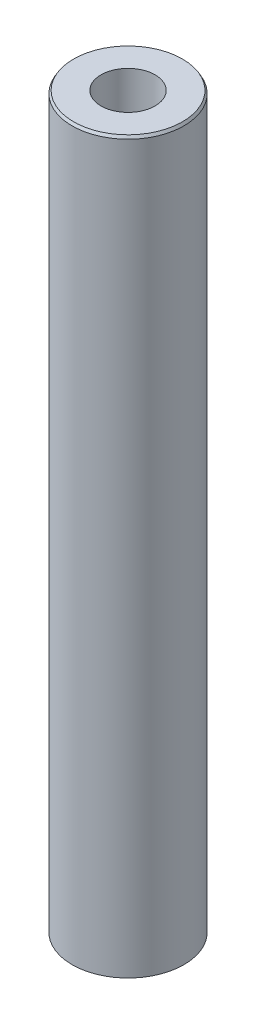
ISO-10303-21;
HEADER;
FILE_DESCRIPTION(('STEP AP214'),'2;1');
FILE_NAME('part.step','',(''),(''),'','','');
FILE_SCHEMA(('AUTOMOTIVE_DESIGN { 1 0 10303 214 1 1 1 1 }'));
ENDSEC;
DATA;
#1=APPLICATION_CONTEXT('core data for automotive mechanical design processes');
#2=APPLICATION_PROTOCOL_DEFINITION('international standard','automotive_design',2000,#1);
#3=PRODUCT_CONTEXT('',#1,'mechanical');
#4=PRODUCT('Part','Part','',(#3));
#5=PRODUCT_RELATED_PRODUCT_CATEGORY('part','',(#4));
#6=PRODUCT_DEFINITION_FORMATION('','',#4);
#7=PRODUCT_DEFINITION_CONTEXT('part definition',#1,'design');
#8=PRODUCT_DEFINITION('design','',#6,#7);
#9=PRODUCT_DEFINITION_SHAPE('','',#8);
#10=(LENGTH_UNIT() NAMED_UNIT(*) SI_UNIT(.MILLI.,.METRE.));
#11=(NAMED_UNIT(*) PLANE_ANGLE_UNIT() SI_UNIT($,.RADIAN.));
#12=(NAMED_UNIT(*) SI_UNIT($,.STERADIAN.) SOLID_ANGLE_UNIT());
#13=UNCERTAINTY_MEASURE_WITH_UNIT(LENGTH_MEASURE(1.E-05),#10,'distance_accuracy_value','');
#14=(GEOMETRIC_REPRESENTATION_CONTEXT(3) GLOBAL_UNCERTAINTY_ASSIGNED_CONTEXT((#13)) GLOBAL_UNIT_ASSIGNED_CONTEXT((#10,
#11,#12)) REPRESENTATION_CONTEXT('',''));
#15=CARTESIAN_POINT('',(0.,0.,0.));
#16=DIRECTION('',(0.,0.,1.));
#17=DIRECTION('',(1.,0.,0.));
#18=AXIS2_PLACEMENT_3D('',#15,#16,#17);
#19=CARTESIAN_POINT('',(0.,554.642758232559,0.));
#20=DIRECTION('',(0.,-1.,0.));
#21=DIRECTION('',(0.,0.,-1.));
#22=AXIS2_PLACEMENT_3D('',#19,#20,#21);
#23=CYLINDRICAL_SURFACE('',#22,42.5);
#24=CARTESIAN_POINT('',(0.,552.577452604285,0.));
#25=DIRECTION('',(0.,1.,0.));
#26=DIRECTION('',(0.,0.,1.));
#27=AXIS2_PLACEMENT_3D('',#24,#25,#26);
#28=CIRCLE('',#27,42.5);
#29=CARTESIAN_POINT('',(0.,552.577452604285,-42.5));
#30=VERTEX_POINT('',#29);
#31=EDGE_CURVE('E50',#30,#30,#28,.F.);
#32=ORIENTED_EDGE('',*,*,#31,.T.);
#33=EDGE_LOOP('',(#32));
#34=FACE_BOUND('',#33,.T.);
#35=CARTESIAN_POINT('',(0.,1.19240476044313,0.));
#36=DIRECTION('',(0.,1.,0.));
#37=DIRECTION('',(0.,0.,1.));
#38=AXIS2_PLACEMENT_3D('',#35,#36,#37);
#39=CIRCLE('',#38,42.5);
#40=CARTESIAN_POINT('',(0.,1.19240476044313,42.5));
#41=VERTEX_POINT('',#40);
#42=EDGE_CURVE('E51',#41,#41,#39,.T.);
#43=ORIENTED_EDGE('',*,*,#42,.T.);
#44=EDGE_LOOP('',(#43));
#45=FACE_BOUND('',#44,.T.);
#46=ADVANCED_FACE('F39',(#34,#45),#23,.T.);
#47=CARTESIAN_POINT('',(0.,554.642758232559,0.));
#48=DIRECTION('',(0.,1.,0.));
#49=DIRECTION('',(0.,0.,1.));
#50=AXIS2_PLACEMENT_3D('',#47,#48,#49);
#51=PLANE('',#50);
#52=CARTESIAN_POINT('',(0.,554.642758232559,0.));
#53=DIRECTION('',(0.,1.,0.));
#54=DIRECTION('',(0.,0.,1.));
#55=AXIS2_PLACEMENT_3D('',#52,#53,#54);
#56=CIRCLE('',#55,41.307595239557);
#57=CARTESIAN_POINT('',(0.,554.642758232559,-41.307595239557));
#58=VERTEX_POINT('',#57);
#59=EDGE_CURVE('E54',#58,#58,#56,.T.);
#60=ORIENTED_EDGE('',*,*,#59,.T.);
#61=EDGE_LOOP('',(#60));
#62=FACE_BOUND('',#61,.T.);
#63=CARTESIAN_POINT('',(0.,554.642758232559,0.));
#64=DIRECTION('',(0.,1.,0.));
#65=DIRECTION('',(0.,0.,1.));
#66=AXIS2_PLACEMENT_3D('',#63,#64,#65);
#67=CIRCLE('',#66,20.510029110894);
#68=CARTESIAN_POINT('',(0.,554.642758232559,20.510029110894));
#69=VERTEX_POINT('',#68);
#70=EDGE_CURVE('E58',#69,#69,#67,.T.);
#71=ORIENTED_EDGE('',*,*,#70,.F.);
#72=EDGE_LOOP('',(#71));
#73=FACE_BOUND('',#72,.T.);
#74=ADVANCED_FACE('F69',(#62,#73),#51,.T.);
#75=CARTESIAN_POINT('',(0.,0.,0.));
#76=DIRECTION('',(0.,1.,0.));
#77=DIRECTION('',(0.,0.,1.));
#78=AXIS2_PLACEMENT_3D('',#75,#76,#77);
#79=PLANE('',#78);
#80=CARTESIAN_POINT('',(0.,0.,0.));
#81=DIRECTION('',(0.,1.,0.));
#82=DIRECTION('',(0.,0.,1.));
#83=AXIS2_PLACEMENT_3D('',#80,#81,#82);
#84=CIRCLE('',#83,40.4346943717255);
#85=CARTESIAN_POINT('',(0.,0.,40.4346943717255));
#86=VERTEX_POINT('',#85);
#87=EDGE_CURVE('E10',#86,#86,#84,.F.);
#88=ORIENTED_EDGE('',*,*,#87,.T.);
#89=EDGE_LOOP('',(#88));
#90=FACE_BOUND('',#89,.T.);
#91=CARTESIAN_POINT('',(0.,0.,0.));
#92=DIRECTION('',(0.,1.,0.));
#93=DIRECTION('',(0.,0.,1.));
#94=AXIS2_PLACEMENT_3D('',#91,#92,#93);
#95=CIRCLE('',#94,20.510029110894);
#96=CARTESIAN_POINT('',(0.,0.,20.510029110894));
#97=VERTEX_POINT('',#96);
#98=EDGE_CURVE('E63',#97,#97,#95,.T.);
#99=ORIENTED_EDGE('',*,*,#98,.T.);
#100=EDGE_LOOP('',(#99));
#101=FACE_BOUND('',#100,.T.);
#102=ADVANCED_FACE('F75',(#90,#101),#79,.F.);
#103=CARTESIAN_POINT('',(0.,554.642758232559,0.));
#104=DIRECTION('',(0.,-1.,0.));
#105=DIRECTION('',(0.,0.,-1.));
#106=AXIS2_PLACEMENT_3D('',#103,#104,#105);
#107=CYLINDRICAL_SURFACE('',#106,20.510029110894);
#108=ORIENTED_EDGE('',*,*,#70,.T.);
#109=EDGE_LOOP('',(#108));
#110=FACE_BOUND('',#109,.T.);
#111=ORIENTED_EDGE('',*,*,#98,.F.);
#112=EDGE_LOOP('',(#111));
#113=FACE_BOUND('',#112,.T.);
#114=ADVANCED_FACE('F70',(#110,#113),#107,.F.);
#115=CARTESIAN_POINT('',(0.,554.642758232559,0.));
#116=DIRECTION('',(0.,-1.,0.));
#117=DIRECTION('',(0.,0.,-1.));
#118=AXIS2_PLACEMENT_3D('',#115,#116,#117);
#119=CONICAL_SURFACE('',#118,41.307595239557,0.52359877559828);
#120=CARTESIAN_POINT('',(0.,552.577452604285,-42.5));
#121=CARTESIAN_POINT('',(0.,552.598966204579,-42.4875791170787));
#122=CARTESIAN_POINT('',(0.,552.620479804874,-42.4751582341575));
#123=CARTESIAN_POINT('',(0.,552.663507005463,-42.4503164683149));
#124=CARTESIAN_POINT('',(0.,552.685020605757,-42.4378955853936));
#125=CARTESIAN_POINT('',(0.,552.728047806347,-42.4130538195511));
#126=CARTESIAN_POINT('',(0.,552.749561406641,-42.4006329366298));
#127=CARTESIAN_POINT('',(0.,552.79258860723,-42.3757911707872));
#128=CARTESIAN_POINT('',(0.,552.814102207525,-42.3633702878659));
#129=CARTESIAN_POINT('',(0.,552.857129408114,-42.3385285220234));
#130=CARTESIAN_POINT('',(0.,552.878643008408,-42.3261076391021));
#131=CARTESIAN_POINT('',(0.,552.921670208997,-42.3012658732595));
#132=CARTESIAN_POINT('',(0.,552.943183809292,-42.2888449903383));
#133=CARTESIAN_POINT('',(0.,552.986211009881,-42.2640032244957));
#134=CARTESIAN_POINT('',(0.,553.007724610175,-42.2515823415744));
#135=CARTESIAN_POINT('',(0.,553.050751810764,-42.2267405757318));
#136=CARTESIAN_POINT('',(0.,553.072265411059,-42.2143196928106));
#137=CARTESIAN_POINT('',(0.,553.115292611648,-42.189477926968));
#138=CARTESIAN_POINT('',(0.,553.136806211942,-42.1770570440467));
#139=CARTESIAN_POINT('',(0.,553.179833412532,-42.1522152782041));
#140=CARTESIAN_POINT('',(0.,553.201347012826,-42.1397943952829));
#141=CARTESIAN_POINT('',(0.,553.244374213415,-42.1149526294403));
#142=CARTESIAN_POINT('',(0.,553.26588781371,-42.102531746519));
#143=CARTESIAN_POINT('',(0.,553.308915014299,-42.0776899806765));
#144=CARTESIAN_POINT('',(0.,553.330428614593,-42.0652690977552));
#145=CARTESIAN_POINT('',(0.,553.373455815182,-42.0404273319126));
#146=CARTESIAN_POINT('',(0.,553.394969415477,-42.0280064489913));
#147=CARTESIAN_POINT('',(0.,553.437996616066,-42.0031646831488));
#148=CARTESIAN_POINT('',(0.,553.45951021636,-41.9907438002275));
#149=CARTESIAN_POINT('',(0.,553.50253741695,-41.9659020343849));
#150=CARTESIAN_POINT('',(0.,553.524051017244,-41.9534811514636));
#151=CARTESIAN_POINT('',(0.,553.567078217833,-41.9286393856211));
#152=CARTESIAN_POINT('',(0.,553.588591818128,-41.9162185026998));
#153=CARTESIAN_POINT('',(0.,553.631619018717,-41.8913767368572));
#154=CARTESIAN_POINT('',(0.,553.653132619011,-41.8789558539359));
#155=CARTESIAN_POINT('',(0.,553.6961598196,-41.8541140880934));
#156=CARTESIAN_POINT('',(0.,553.717673419895,-41.8416932051721));
#157=CARTESIAN_POINT('',(0.,553.760700620484,-41.8168514393295));
#158=CARTESIAN_POINT('',(0.,553.782214220778,-41.8044305564083));
#159=CARTESIAN_POINT('',(0.,553.825241421367,-41.7795887905657));
#160=CARTESIAN_POINT('',(0.,553.846755021662,-41.7671679076444));
#161=CARTESIAN_POINT('',(0.,553.889782222251,-41.7423261418019));
#162=CARTESIAN_POINT('',(0.,553.911295822545,-41.7299052588806));
#163=CARTESIAN_POINT('',(0.,553.954323023135,-41.705063493038));
#164=CARTESIAN_POINT('',(0.,553.975836623429,-41.6926426101167));
#165=CARTESIAN_POINT('',(0.,554.018863824018,-41.6678008442742));
#166=CARTESIAN_POINT('',(0.,554.040377424313,-41.6553799613529));
#167=CARTESIAN_POINT('',(0.,554.083404624902,-41.6305381955103));
#168=CARTESIAN_POINT('',(0.,554.104918225196,-41.618117312589));
#169=CARTESIAN_POINT('',(0.,554.147945425785,-41.5932755467465));
#170=CARTESIAN_POINT('',(0.,554.16945902608,-41.5808546638252));
#171=CARTESIAN_POINT('',(0.,554.212486226669,-41.5560128979826));
#172=CARTESIAN_POINT('',(0.,554.233999826963,-41.5435920150613));
#173=CARTESIAN_POINT('',(0.,554.277027027552,-41.5187502492188));
#174=CARTESIAN_POINT('',(0.,554.298540627847,-41.5063293662975));
#175=CARTESIAN_POINT('',(0.,554.341567828436,-41.4814876004549));
#176=CARTESIAN_POINT('',(0.,554.36308142873,-41.4690667175337));
#177=CARTESIAN_POINT('',(0.,554.40610862932,-41.4442249516911));
#178=CARTESIAN_POINT('',(0.,554.427622229614,-41.4318040687698));
#179=CARTESIAN_POINT('',(0.,554.470649430203,-41.4069623029272));
#180=CARTESIAN_POINT('',(0.,554.492163030498,-41.394541420006));
#181=CARTESIAN_POINT('',(0.,554.535190231087,-41.3696996541634));
#182=CARTESIAN_POINT('',(0.,554.556703831381,-41.3572787712421));
#183=CARTESIAN_POINT('',(0.,554.59973103197,-41.3324370053996));
#184=CARTESIAN_POINT('',(0.,554.621244632265,-41.3200161224783));
#185=CARTESIAN_POINT('',(0.,554.642758232559,-41.307595239557));
#186=B_SPLINE_CURVE_WITH_KNOTS('',3,(#120,#121,#122,#123,#124,#125,#126,#127,#128,#129,#130,
#131,#132,#133,#134,#135,#136,#137,#138,#139,#140,#141,#142,#143,#144,#145,#146,#147,#148,#149,
#150,#151,#152,#153,#154,#155,#156,#157,#158,#159,#160,#161,#162,#163,#164,#165,#166,#167,#168,
#169,#170,#171,#172,#173,#174,#175,#176,#177,#178,#179,#180,#181,#182,#183,#184,#185),
.UNSPECIFIED.,.F.,.F.,(4,2,2,2,2,2,2,2,2,2,2,2,2,2,2,2,2,2,2,2,2,2,2,2,2,2,2,2,2,2,2,2,4),(0.,
0.074525297527606,0.149050595055305,0.223575892583003,0.298101190110702,0.372626487638401,
0.447151785166099,0.521677082693798,0.596202380221497,0.670727677749199,0.745252975276897,
0.819778272804596,0.894303570332295,0.968828867859993,1.04335416538769,1.11787946291539,
1.19240476044309,1.2669300579707,1.34145535549839,1.41598065302609,1.49050595055379,
1.56503124808149,1.63955654560919,1.71408184313689,1.78860714066459,1.86313243819229,
1.93765773571999,2.01218303324769,2.08670833077538,2.16123362830308,2.23575892583078,
2.31028422335848,2.38480952088618),.UNSPECIFIED.);
#187=EDGE_CURVE('BSEAM81',#30,#58,#186,.T.);
#188=ORIENTED_EDGE('',*,*,#31,.F.);
#189=ORIENTED_EDGE('',*,*,#59,.F.);
#190=ORIENTED_EDGE('',*,*,#187,.T.);
#191=ORIENTED_EDGE('',*,*,#187,.F.);
#192=EDGE_LOOP('',(#188,#190,#189,#191));
#193=FACE_BOUND('',#192,.T.);
#194=ADVANCED_FACE('F81',(#193),#119,.T.);
#195=CARTESIAN_POINT('',(0.,1.19240476044313,0.));
#196=DIRECTION('',(0.,1.,0.));
#197=DIRECTION('',(0.,0.,1.));
#198=AXIS2_PLACEMENT_3D('',#195,#196,#197);
#199=CONICAL_SURFACE('',#198,42.5,1.0471975511966);
#200=ORIENTED_EDGE('',*,*,#87,.F.);
#201=EDGE_LOOP('',(#200));
#202=FACE_BOUND('',#201,.T.);
#203=ORIENTED_EDGE('',*,*,#42,.F.);
#204=EDGE_LOOP('',(#203));
#205=FACE_BOUND('',#204,.T.);
#206=ADVANCED_FACE('F45',(#202,#205),#199,.T.);
#207=CLOSED_SHELL('',(#46,#74,#102,#114,#194,#206));
#208=MANIFOLD_SOLID_BREP('B2',#207);
#209=ADVANCED_BREP_SHAPE_REPRESENTATION('',(#18,#208),#14);
#210=SHAPE_DEFINITION_REPRESENTATION(#9,#209);
ENDSEC;
END-ISO-10303-21;
